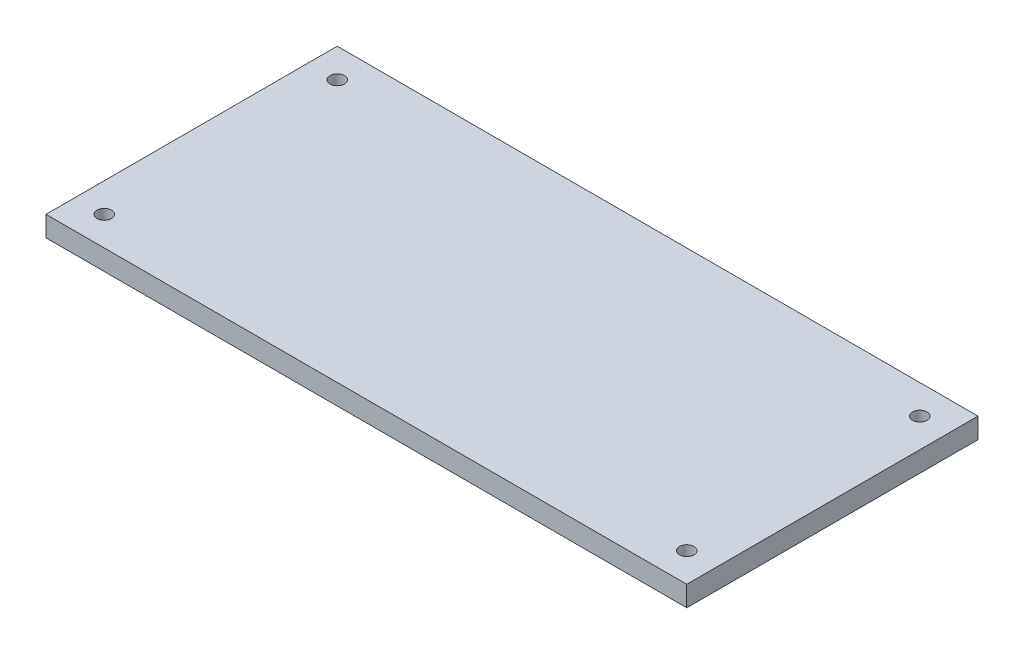
ISO-10303-21;
HEADER;
FILE_DESCRIPTION(('STEP AP214'),'2;1');
FILE_NAME('part.step','',(''),(''),'','','');
FILE_SCHEMA(('AUTOMOTIVE_DESIGN { 1 0 10303 214 1 1 1 1 }'));
ENDSEC;
DATA;
#1=APPLICATION_CONTEXT('core data for automotive mechanical design processes');
#2=APPLICATION_PROTOCOL_DEFINITION('international standard','automotive_design',2000,#1);
#3=PRODUCT_CONTEXT('',#1,'mechanical');
#4=PRODUCT('Part','Part','',(#3));
#5=PRODUCT_RELATED_PRODUCT_CATEGORY('part','',(#4));
#6=PRODUCT_DEFINITION_FORMATION('','',#4);
#7=PRODUCT_DEFINITION_CONTEXT('part definition',#1,'design');
#8=PRODUCT_DEFINITION('design','',#6,#7);
#9=PRODUCT_DEFINITION_SHAPE('','',#8);
#10=(LENGTH_UNIT() NAMED_UNIT(*) SI_UNIT(.MILLI.,.METRE.));
#11=(NAMED_UNIT(*) PLANE_ANGLE_UNIT() SI_UNIT($,.RADIAN.));
#12=(NAMED_UNIT(*) SI_UNIT($,.STERADIAN.) SOLID_ANGLE_UNIT());
#13=UNCERTAINTY_MEASURE_WITH_UNIT(LENGTH_MEASURE(1.E-05),#10,'distance_accuracy_value','');
#14=(GEOMETRIC_REPRESENTATION_CONTEXT(3) GLOBAL_UNCERTAINTY_ASSIGNED_CONTEXT((#13)) GLOBAL_UNIT_ASSIGNED_CONTEXT((#10,
#11,#12)) REPRESENTATION_CONTEXT('',''));
#15=CARTESIAN_POINT('',(0.,0.,0.));
#16=DIRECTION('',(0.,0.,1.));
#17=DIRECTION('',(1.,0.,0.));
#18=AXIS2_PLACEMENT_3D('',#15,#16,#17);
#19=CARTESIAN_POINT('',(0.,8.89,0.));
#20=DIRECTION('',(0.,1.,0.));
#21=DIRECTION('',(0.,0.,1.));
#22=AXIS2_PLACEMENT_3D('',#19,#20,#21);
#23=PLANE('',#22);
#24=CARTESIAN_POINT('',(266.7,8.89,12.7));
#25=DIRECTION('',(0.,1.,0.));
#26=DIRECTION('',(0.,0.,1.));
#27=AXIS2_PLACEMENT_3D('',#24,#25,#26);
#28=CIRCLE('',#27,3.17499999999997);
#29=CARTESIAN_POINT('',(266.7,8.89,15.875));
#30=VERTEX_POINT('',#29);
#31=EDGE_CURVE('E142',#30,#30,#28,.T.);
#32=ORIENTED_EDGE('',*,*,#31,.F.);
#33=EDGE_LOOP('',(#32));
#34=FACE_BOUND('',#33,.T.);
#35=CARTESIAN_POINT('',(12.7,8.89,12.7));
#36=DIRECTION('',(0.,1.,0.));
#37=DIRECTION('',(0.,0.,1.));
#38=AXIS2_PLACEMENT_3D('',#35,#36,#37);
#39=CIRCLE('',#38,3.175);
#40=CARTESIAN_POINT('',(12.7,8.89,15.875));
#41=VERTEX_POINT('',#40);
#42=EDGE_CURVE('E112',#41,#41,#39,.T.);
#43=ORIENTED_EDGE('',*,*,#42,.F.);
#44=EDGE_LOOP('',(#43));
#45=FACE_BOUND('',#44,.T.);
#46=DIRECTION('',(0.,0.,1.));
#47=VECTOR('',#46,1.);
#48=CARTESIAN_POINT('',(0.,8.89,0.));
#49=LINE('',#48,#47);
#50=CARTESIAN_POINT('',(0.,8.89,0.));
#51=VERTEX_POINT('',#50);
#52=CARTESIAN_POINT('',(0.,8.89,127.));
#53=VERTEX_POINT('',#52);
#54=EDGE_CURVE('E92',#51,#53,#49,.T.);
#55=ORIENTED_EDGE('',*,*,#54,.T.);
#56=DIRECTION('',(1.,0.,0.));
#57=VECTOR('',#56,1.);
#58=CARTESIAN_POINT('',(0.,8.89,127.));
#59=LINE('',#58,#57);
#60=CARTESIAN_POINT('',(279.4,8.89,127.));
#61=VERTEX_POINT('',#60);
#62=EDGE_CURVE('E87',#53,#61,#59,.T.);
#63=ORIENTED_EDGE('',*,*,#62,.T.);
#64=DIRECTION('',(0.,0.,-1.));
#65=VECTOR('',#64,1.);
#66=CARTESIAN_POINT('',(279.4,8.89,0.));
#67=LINE('',#66,#65);
#68=CARTESIAN_POINT('',(279.4,8.89,0.));
#69=VERTEX_POINT('',#68);
#70=EDGE_CURVE('E90',#61,#69,#67,.T.);
#71=ORIENTED_EDGE('',*,*,#70,.T.);
#72=DIRECTION('',(-1.,0.,0.));
#73=VECTOR('',#72,1.);
#74=CARTESIAN_POINT('',(0.,8.89,0.));
#75=LINE('',#74,#73);
#76=EDGE_CURVE('E57',#69,#51,#75,.T.);
#77=ORIENTED_EDGE('',*,*,#76,.T.);
#78=EDGE_LOOP('',(#55,#63,#71,#77));
#79=FACE_BOUND('',#78,.T.);
#80=CARTESIAN_POINT('',(12.7,8.89,114.3));
#81=DIRECTION('',(0.,1.,0.));
#82=DIRECTION('',(0.,0.,1.));
#83=AXIS2_PLACEMENT_3D('',#80,#81,#82);
#84=CIRCLE('',#83,3.175);
#85=CARTESIAN_POINT('',(12.7,8.89,117.475));
#86=VERTEX_POINT('',#85);
#87=EDGE_CURVE('E134',#86,#86,#84,.T.);
#88=ORIENTED_EDGE('',*,*,#87,.F.);
#89=EDGE_LOOP('',(#88));
#90=FACE_BOUND('',#89,.T.);
#91=CARTESIAN_POINT('',(266.7,8.89,114.3));
#92=DIRECTION('',(0.,1.,0.));
#93=DIRECTION('',(0.,0.,1.));
#94=AXIS2_PLACEMENT_3D('',#91,#92,#93);
#95=CIRCLE('',#94,3.17499999999997);
#96=CARTESIAN_POINT('',(266.7,8.89,117.475));
#97=VERTEX_POINT('',#96);
#98=EDGE_CURVE('E150',#97,#97,#95,.T.);
#99=ORIENTED_EDGE('',*,*,#98,.F.);
#100=EDGE_LOOP('',(#99));
#101=FACE_BOUND('',#100,.T.);
#102=ADVANCED_FACE('F39',(#34,#45,#79,#90,#101),#23,.T.);
#103=CARTESIAN_POINT('',(0.,0.,0.));
#104=DIRECTION('',(0.,1.,0.));
#105=DIRECTION('',(0.,0.,1.));
#106=AXIS2_PLACEMENT_3D('',#103,#104,#105);
#107=PLANE('',#106);
#108=DIRECTION('',(0.,0.,1.));
#109=VECTOR('',#108,1.);
#110=CARTESIAN_POINT('',(0.,0.,0.));
#111=LINE('',#110,#109);
#112=CARTESIAN_POINT('',(0.,0.,0.));
#113=VERTEX_POINT('',#112);
#114=CARTESIAN_POINT('',(0.,0.,127.));
#115=VERTEX_POINT('',#114);
#116=EDGE_CURVE('E108',#113,#115,#111,.T.);
#117=ORIENTED_EDGE('',*,*,#116,.F.);
#118=DIRECTION('',(-1.,0.,0.));
#119=VECTOR('',#118,1.);
#120=CARTESIAN_POINT('',(0.,0.,0.));
#121=LINE('',#120,#119);
#122=CARTESIAN_POINT('',(279.4,0.,0.));
#123=VERTEX_POINT('',#122);
#124=EDGE_CURVE('E80',#123,#113,#121,.T.);
#125=ORIENTED_EDGE('',*,*,#124,.F.);
#126=DIRECTION('',(0.,0.,-1.));
#127=VECTOR('',#126,1.);
#128=CARTESIAN_POINT('',(279.4,0.,0.));
#129=LINE('',#128,#127);
#130=CARTESIAN_POINT('',(279.4,0.,127.));
#131=VERTEX_POINT('',#130);
#132=EDGE_CURVE('E74',#131,#123,#129,.T.);
#133=ORIENTED_EDGE('',*,*,#132,.F.);
#134=DIRECTION('',(1.,0.,0.));
#135=VECTOR('',#134,1.);
#136=CARTESIAN_POINT('',(0.,0.,127.));
#137=LINE('',#136,#135);
#138=EDGE_CURVE('E97',#115,#131,#137,.T.);
#139=ORIENTED_EDGE('',*,*,#138,.F.);
#140=EDGE_LOOP('',(#117,#125,#133,#139));
#141=FACE_BOUND('',#140,.T.);
#142=CARTESIAN_POINT('',(12.7,0.,12.7));
#143=DIRECTION('',(0.,1.,0.));
#144=DIRECTION('',(0.,0.,1.));
#145=AXIS2_PLACEMENT_3D('',#142,#143,#144);
#146=CIRCLE('',#145,3.175);
#147=CARTESIAN_POINT('',(12.7,0.,15.875));
#148=VERTEX_POINT('',#147);
#149=EDGE_CURVE('E130',#148,#148,#146,.T.);
#150=ORIENTED_EDGE('',*,*,#149,.T.);
#151=EDGE_LOOP('',(#150));
#152=FACE_BOUND('',#151,.T.);
#153=CARTESIAN_POINT('',(12.7,0.,114.3));
#154=DIRECTION('',(0.,1.,0.));
#155=DIRECTION('',(0.,0.,1.));
#156=AXIS2_PLACEMENT_3D('',#153,#154,#155);
#157=CIRCLE('',#156,3.175);
#158=CARTESIAN_POINT('',(12.7,0.,117.475));
#159=VERTEX_POINT('',#158);
#160=EDGE_CURVE('E138',#159,#159,#157,.T.);
#161=ORIENTED_EDGE('',*,*,#160,.T.);
#162=EDGE_LOOP('',(#161));
#163=FACE_BOUND('',#162,.T.);
#164=CARTESIAN_POINT('',(266.7,0.,12.7));
#165=DIRECTION('',(0.,1.,0.));
#166=DIRECTION('',(0.,0.,1.));
#167=AXIS2_PLACEMENT_3D('',#164,#165,#166);
#168=CIRCLE('',#167,3.17499999999997);
#169=CARTESIAN_POINT('',(266.7,0.,15.875));
#170=VERTEX_POINT('',#169);
#171=EDGE_CURVE('E146',#170,#170,#168,.T.);
#172=ORIENTED_EDGE('',*,*,#171,.T.);
#173=EDGE_LOOP('',(#172));
#174=FACE_BOUND('',#173,.T.);
#175=CARTESIAN_POINT('',(266.7,0.,114.3));
#176=DIRECTION('',(0.,1.,0.));
#177=DIRECTION('',(0.,0.,1.));
#178=AXIS2_PLACEMENT_3D('',#175,#176,#177);
#179=CIRCLE('',#178,3.17499999999997);
#180=CARTESIAN_POINT('',(266.7,0.,117.475));
#181=VERTEX_POINT('',#180);
#182=EDGE_CURVE('E154',#181,#181,#179,.T.);
#183=ORIENTED_EDGE('',*,*,#182,.T.);
#184=EDGE_LOOP('',(#183));
#185=FACE_BOUND('',#184,.T.);
#186=ADVANCED_FACE('F125',(#141,#152,#163,#174,#185),#107,.F.);
#187=CARTESIAN_POINT('',(0.,8.89,0.));
#188=DIRECTION('',(1.,0.,0.));
#189=DIRECTION('',(0.,0.,-1.));
#190=AXIS2_PLACEMENT_3D('',#187,#188,#189);
#191=PLANE('',#190);
#192=ORIENTED_EDGE('',*,*,#116,.T.);
#193=DIRECTION('',(0.,-1.,0.));
#194=VECTOR('',#193,1.);
#195=CARTESIAN_POINT('',(0.,8.89,127.));
#196=LINE('',#195,#194);
#197=EDGE_CURVE('E11',#53,#115,#196,.T.);
#198=ORIENTED_EDGE('',*,*,#197,.F.);
#199=ORIENTED_EDGE('',*,*,#54,.F.);
#200=DIRECTION('',(0.,-1.,0.));
#201=VECTOR('',#200,1.);
#202=CARTESIAN_POINT('',(0.,8.89,0.));
#203=LINE('',#202,#201);
#204=EDGE_CURVE('E104',#51,#113,#203,.T.);
#205=ORIENTED_EDGE('',*,*,#204,.T.);
#206=EDGE_LOOP('',(#192,#198,#199,#205));
#207=FACE_BOUND('',#206,.T.);
#208=ADVANCED_FACE('F41',(#207),#191,.F.);
#209=CARTESIAN_POINT('',(0.,8.89,127.));
#210=DIRECTION('',(0.,0.,-1.));
#211=DIRECTION('',(-1.,0.,0.));
#212=AXIS2_PLACEMENT_3D('',#209,#210,#211);
#213=PLANE('',#212);
#214=ORIENTED_EDGE('',*,*,#138,.T.);
#215=DIRECTION('',(0.,-1.,0.));
#216=VECTOR('',#215,1.);
#217=CARTESIAN_POINT('',(279.4,8.89,127.));
#218=LINE('',#217,#216);
#219=EDGE_CURVE('E49',#61,#131,#218,.T.);
#220=ORIENTED_EDGE('',*,*,#219,.F.);
#221=ORIENTED_EDGE('',*,*,#62,.F.);
#222=ORIENTED_EDGE('',*,*,#197,.T.);
#223=EDGE_LOOP('',(#214,#220,#221,#222));
#224=FACE_BOUND('',#223,.T.);
#225=ADVANCED_FACE('F96',(#224),#213,.F.);
#226=CARTESIAN_POINT('',(279.4,8.89,0.));
#227=DIRECTION('',(-1.,0.,0.));
#228=DIRECTION('',(0.,0.,1.));
#229=AXIS2_PLACEMENT_3D('',#226,#227,#228);
#230=PLANE('',#229);
#231=ORIENTED_EDGE('',*,*,#132,.T.);
#232=DIRECTION('',(0.,-1.,0.));
#233=VECTOR('',#232,1.);
#234=CARTESIAN_POINT('',(279.4,8.89,0.));
#235=LINE('',#234,#233);
#236=EDGE_CURVE('E99',#69,#123,#235,.T.);
#237=ORIENTED_EDGE('',*,*,#236,.F.);
#238=ORIENTED_EDGE('',*,*,#70,.F.);
#239=ORIENTED_EDGE('',*,*,#219,.T.);
#240=EDGE_LOOP('',(#231,#237,#238,#239));
#241=FACE_BOUND('',#240,.T.);
#242=ADVANCED_FACE('F100',(#241),#230,.F.);
#243=CARTESIAN_POINT('',(0.,8.89,0.));
#244=DIRECTION('',(0.,0.,1.));
#245=DIRECTION('',(1.,0.,0.));
#246=AXIS2_PLACEMENT_3D('',#243,#244,#245);
#247=PLANE('',#246);
#248=ORIENTED_EDGE('',*,*,#124,.T.);
#249=ORIENTED_EDGE('',*,*,#204,.F.);
#250=ORIENTED_EDGE('',*,*,#76,.F.);
#251=ORIENTED_EDGE('',*,*,#236,.T.);
#252=EDGE_LOOP('',(#248,#249,#250,#251));
#253=FACE_BOUND('',#252,.T.);
#254=ADVANCED_FACE('F122',(#253),#247,.F.);
#255=CARTESIAN_POINT('',(12.7,8.89,12.7));
#256=DIRECTION('',(0.,-1.,0.));
#257=DIRECTION('',(0.,0.,-1.));
#258=AXIS2_PLACEMENT_3D('',#255,#256,#257);
#259=CYLINDRICAL_SURFACE('',#258,3.175);
#260=ORIENTED_EDGE('',*,*,#42,.T.);
#261=EDGE_LOOP('',(#260));
#262=FACE_BOUND('',#261,.T.);
#263=ORIENTED_EDGE('',*,*,#149,.F.);
#264=EDGE_LOOP('',(#263));
#265=FACE_BOUND('',#264,.T.);
#266=ADVANCED_FACE('F175',(#262,#265),#259,.F.);
#267=CARTESIAN_POINT('',(12.7,8.89,114.3));
#268=DIRECTION('',(0.,-1.,0.));
#269=DIRECTION('',(0.,0.,-1.));
#270=AXIS2_PLACEMENT_3D('',#267,#268,#269);
#271=CYLINDRICAL_SURFACE('',#270,3.175);
#272=ORIENTED_EDGE('',*,*,#87,.T.);
#273=EDGE_LOOP('',(#272));
#274=FACE_BOUND('',#273,.T.);
#275=ORIENTED_EDGE('',*,*,#160,.F.);
#276=EDGE_LOOP('',(#275));
#277=FACE_BOUND('',#276,.T.);
#278=ADVANCED_FACE('F221',(#274,#277),#271,.F.);
#279=CARTESIAN_POINT('',(266.7,8.89,12.7));
#280=DIRECTION('',(0.,-1.,0.));
#281=DIRECTION('',(0.,0.,-1.));
#282=AXIS2_PLACEMENT_3D('',#279,#280,#281);
#283=CYLINDRICAL_SURFACE('',#282,3.17499999999997);
#284=ORIENTED_EDGE('',*,*,#31,.T.);
#285=EDGE_LOOP('',(#284));
#286=FACE_BOUND('',#285,.T.);
#287=ORIENTED_EDGE('',*,*,#171,.F.);
#288=EDGE_LOOP('',(#287));
#289=FACE_BOUND('',#288,.T.);
#290=ADVANCED_FACE('F229',(#286,#289),#283,.F.);
#291=CARTESIAN_POINT('',(266.7,8.89,114.3));
#292=DIRECTION('',(0.,-1.,0.));
#293=DIRECTION('',(0.,0.,-1.));
#294=AXIS2_PLACEMENT_3D('',#291,#292,#293);
#295=CYLINDRICAL_SURFACE('',#294,3.17499999999997);
#296=ORIENTED_EDGE('',*,*,#98,.T.);
#297=EDGE_LOOP('',(#296));
#298=FACE_BOUND('',#297,.T.);
#299=ORIENTED_EDGE('',*,*,#182,.F.);
#300=EDGE_LOOP('',(#299));
#301=FACE_BOUND('',#300,.T.);
#302=ADVANCED_FACE('F162',(#298,#301),#295,.F.);
#303=CLOSED_SHELL('',(#102,#186,#208,#225,#242,#254,#266,#278,#290,#302));
#304=MANIFOLD_SOLID_BREP('B2',#303);
#305=ADVANCED_BREP_SHAPE_REPRESENTATION('',(#18,#304),#14);
#306=SHAPE_DEFINITION_REPRESENTATION(#9,#305);
ENDSEC;
END-ISO-10303-21;
